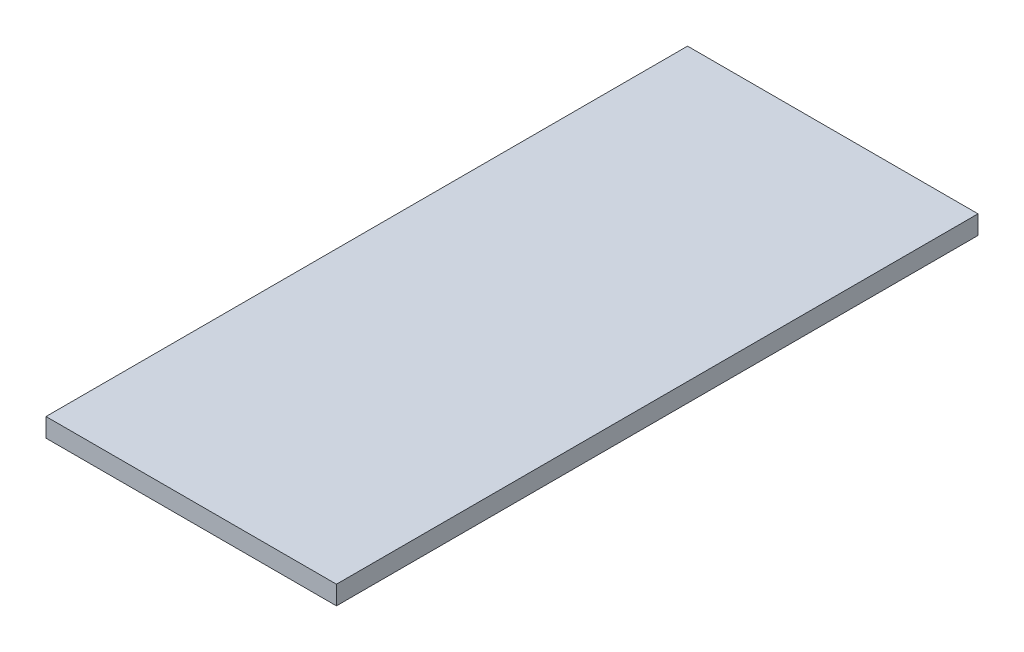
ISO-10303-21;
HEADER;
FILE_DESCRIPTION(('STEP AP214'),'2;1');
FILE_NAME('part.step','',(''),(''),'','','');
FILE_SCHEMA(('AUTOMOTIVE_DESIGN { 1 0 10303 214 1 1 1 1 }'));
ENDSEC;
DATA;
#1=APPLICATION_CONTEXT('core data for automotive mechanical design processes');
#2=APPLICATION_PROTOCOL_DEFINITION('international standard','automotive_design',2000,#1);
#3=PRODUCT_CONTEXT('',#1,'mechanical');
#4=PRODUCT('Part','Part','',(#3));
#5=PRODUCT_RELATED_PRODUCT_CATEGORY('part','',(#4));
#6=PRODUCT_DEFINITION_FORMATION('','',#4);
#7=PRODUCT_DEFINITION_CONTEXT('part definition',#1,'design');
#8=PRODUCT_DEFINITION('design','',#6,#7);
#9=PRODUCT_DEFINITION_SHAPE('','',#8);
#10=(LENGTH_UNIT() NAMED_UNIT(*) SI_UNIT(.MILLI.,.METRE.));
#11=(NAMED_UNIT(*) PLANE_ANGLE_UNIT() SI_UNIT($,.RADIAN.));
#12=(NAMED_UNIT(*) SI_UNIT($,.STERADIAN.) SOLID_ANGLE_UNIT());
#13=UNCERTAINTY_MEASURE_WITH_UNIT(LENGTH_MEASURE(1.E-05),#10,'distance_accuracy_value','');
#14=(GEOMETRIC_REPRESENTATION_CONTEXT(3) GLOBAL_UNCERTAINTY_ASSIGNED_CONTEXT((#13)) GLOBAL_UNIT_ASSIGNED_CONTEXT((#10,
#11,#12)) REPRESENTATION_CONTEXT('',''));
#15=CARTESIAN_POINT('',(0.,0.,0.));
#16=DIRECTION('',(0.,0.,1.));
#17=DIRECTION('',(1.,0.,0.));
#18=AXIS2_PLACEMENT_3D('',#15,#16,#17);
#19=CARTESIAN_POINT('',(484.407028553005,35.,-1190.08106279291));
#20=DIRECTION('',(0.,0.,1.));
#21=DIRECTION('',(1.,0.,0.));
#22=AXIS2_PLACEMENT_3D('',#19,#20,#21);
#23=PLANE('',#22);
#24=DIRECTION('',(-1.,0.,0.));
#25=VECTOR('',#24,1.);
#26=CARTESIAN_POINT('',(484.407028553005,0.,-1190.08106279291));
#27=LINE('',#26,#25);
#28=CARTESIAN_POINT('',(484.407028553005,0.,-1190.08106279291));
#29=VERTEX_POINT('',#28);
#30=CARTESIAN_POINT('',(-56.5929714469953,0.,-1190.08106279291));
#31=VERTEX_POINT('',#30);
#32=EDGE_CURVE('E102',#29,#31,#27,.T.);
#33=ORIENTED_EDGE('',*,*,#32,.T.);
#34=DIRECTION('',(0.,-1.,0.));
#35=VECTOR('',#34,1.);
#36=CARTESIAN_POINT('',(-56.5929714469953,35.,-1190.08106279291));
#37=LINE('',#36,#35);
#38=CARTESIAN_POINT('',(-56.5929714469953,35.,-1190.08106279291));
#39=VERTEX_POINT('',#38);
#40=EDGE_CURVE('E11',#39,#31,#37,.T.);
#41=ORIENTED_EDGE('',*,*,#40,.F.);
#42=DIRECTION('',(-1.,0.,0.));
#43=VECTOR('',#42,1.);
#44=CARTESIAN_POINT('',(484.407028553005,35.,-1190.08106279291));
#45=LINE('',#44,#43);
#46=CARTESIAN_POINT('',(484.407028553005,35.,-1190.08106279291));
#47=VERTEX_POINT('',#46);
#48=EDGE_CURVE('E90',#47,#39,#45,.T.);
#49=ORIENTED_EDGE('',*,*,#48,.F.);
#50=DIRECTION('',(0.,-1.,0.));
#51=VECTOR('',#50,1.);
#52=CARTESIAN_POINT('',(484.407028553005,35.,-1190.08106279291));
#53=LINE('',#52,#51);
#54=EDGE_CURVE('E98',#47,#29,#53,.T.);
#55=ORIENTED_EDGE('',*,*,#54,.T.);
#56=EDGE_LOOP('',(#33,#41,#49,#55));
#57=FACE_BOUND('',#56,.T.);
#58=ADVANCED_FACE('F39',(#57),#23,.F.);
#59=CARTESIAN_POINT('',(-56.5929714469953,35.,-1190.08106279291));
#60=DIRECTION('',(1.,0.,0.));
#61=DIRECTION('',(0.,0.,-1.));
#62=AXIS2_PLACEMENT_3D('',#59,#60,#61);
#63=PLANE('',#62);
#64=DIRECTION('',(0.,0.,1.));
#65=VECTOR('',#64,1.);
#66=CARTESIAN_POINT('',(-56.5929714469953,0.,-1190.08106279291));
#67=LINE('',#66,#65);
#68=CARTESIAN_POINT('',(-56.5929714469952,0.,4.91893720708857));
#69=VERTEX_POINT('',#68);
#70=EDGE_CURVE('E94',#31,#69,#67,.T.);
#71=ORIENTED_EDGE('',*,*,#70,.T.);
#72=DIRECTION('',(0.,-1.,0.));
#73=VECTOR('',#72,1.);
#74=CARTESIAN_POINT('',(-56.5929714469952,35.,4.91893720708857));
#75=LINE('',#74,#73);
#76=CARTESIAN_POINT('',(-56.5929714469952,35.,4.91893720708857));
#77=VERTEX_POINT('',#76);
#78=EDGE_CURVE('E47',#77,#69,#75,.T.);
#79=ORIENTED_EDGE('',*,*,#78,.F.);
#80=DIRECTION('',(0.,0.,1.));
#81=VECTOR('',#80,1.);
#82=CARTESIAN_POINT('',(-56.5929714469953,35.,-1190.08106279291));
#83=LINE('',#82,#81);
#84=EDGE_CURVE('E85',#39,#77,#83,.T.);
#85=ORIENTED_EDGE('',*,*,#84,.F.);
#86=ORIENTED_EDGE('',*,*,#40,.T.);
#87=EDGE_LOOP('',(#71,#79,#85,#86));
#88=FACE_BOUND('',#87,.T.);
#89=ADVANCED_FACE('F93',(#88),#63,.F.);
#90=CARTESIAN_POINT('',(-56.5929714469952,35.,4.91893720708857));
#91=DIRECTION('',(0.,0.,-1.));
#92=DIRECTION('',(-1.,0.,0.));
#93=AXIS2_PLACEMENT_3D('',#90,#91,#92);
#94=PLANE('',#93);
#95=DIRECTION('',(1.,0.,0.));
#96=VECTOR('',#95,1.);
#97=CARTESIAN_POINT('',(-56.5929714469952,0.,4.91893720708857));
#98=LINE('',#97,#96);
#99=CARTESIAN_POINT('',(484.407028553005,0.,4.91893720708857));
#100=VERTEX_POINT('',#99);
#101=EDGE_CURVE('E72',#69,#100,#98,.T.);
#102=ORIENTED_EDGE('',*,*,#101,.T.);
#103=DIRECTION('',(0.,-1.,0.));
#104=VECTOR('',#103,1.);
#105=CARTESIAN_POINT('',(484.407028553005,35.,4.91893720708857));
#106=LINE('',#105,#104);
#107=CARTESIAN_POINT('',(484.407028553005,35.,4.91893720708857));
#108=VERTEX_POINT('',#107);
#109=EDGE_CURVE('E95',#108,#100,#106,.T.);
#110=ORIENTED_EDGE('',*,*,#109,.F.);
#111=DIRECTION('',(1.,0.,0.));
#112=VECTOR('',#111,1.);
#113=CARTESIAN_POINT('',(-56.5929714469952,35.,4.91893720708857));
#114=LINE('',#113,#112);
#115=EDGE_CURVE('E88',#77,#108,#114,.T.);
#116=ORIENTED_EDGE('',*,*,#115,.F.);
#117=ORIENTED_EDGE('',*,*,#78,.T.);
#118=EDGE_LOOP('',(#102,#110,#116,#117));
#119=FACE_BOUND('',#118,.T.);
#120=ADVANCED_FACE('F96',(#119),#94,.F.);
#121=CARTESIAN_POINT('',(484.407028553005,35.,4.91893720708857));
#122=DIRECTION('',(-1.,0.,0.));
#123=DIRECTION('',(0.,0.,1.));
#124=AXIS2_PLACEMENT_3D('',#121,#122,#123);
#125=PLANE('',#124);
#126=DIRECTION('',(0.,0.,-1.));
#127=VECTOR('',#126,1.);
#128=CARTESIAN_POINT('',(484.407028553005,0.,4.91893720708857));
#129=LINE('',#128,#127);
#130=EDGE_CURVE('E78',#100,#29,#129,.T.);
#131=ORIENTED_EDGE('',*,*,#130,.T.);
#132=ORIENTED_EDGE('',*,*,#54,.F.);
#133=DIRECTION('',(0.,0.,-1.));
#134=VECTOR('',#133,1.);
#135=CARTESIAN_POINT('',(484.407028553005,35.,4.91893720708857));
#136=LINE('',#135,#134);
#137=EDGE_CURVE('E55',#108,#47,#136,.T.);
#138=ORIENTED_EDGE('',*,*,#137,.F.);
#139=ORIENTED_EDGE('',*,*,#109,.T.);
#140=EDGE_LOOP('',(#131,#132,#138,#139));
#141=FACE_BOUND('',#140,.T.);
#142=ADVANCED_FACE('F109',(#141),#125,.F.);
#143=CARTESIAN_POINT('',(0.,35.,0.));
#144=DIRECTION('',(0.,1.,0.));
#145=DIRECTION('',(0.,0.,1.));
#146=AXIS2_PLACEMENT_3D('',#143,#144,#145);
#147=PLANE('',#146);
#148=ORIENTED_EDGE('',*,*,#48,.T.);
#149=ORIENTED_EDGE('',*,*,#84,.T.);
#150=ORIENTED_EDGE('',*,*,#115,.T.);
#151=ORIENTED_EDGE('',*,*,#137,.T.);
#152=EDGE_LOOP('',(#148,#149,#150,#151));
#153=FACE_BOUND('',#152,.T.);
#154=ADVANCED_FACE('F86',(#153),#147,.T.);
#155=CARTESIAN_POINT('',(0.,0.,0.));
#156=DIRECTION('',(0.,1.,0.));
#157=DIRECTION('',(0.,0.,1.));
#158=AXIS2_PLACEMENT_3D('',#155,#156,#157);
#159=PLANE('',#158);
#160=ORIENTED_EDGE('',*,*,#32,.F.);
#161=ORIENTED_EDGE('',*,*,#130,.F.);
#162=ORIENTED_EDGE('',*,*,#101,.F.);
#163=ORIENTED_EDGE('',*,*,#70,.F.);
#164=EDGE_LOOP('',(#160,#161,#162,#163));
#165=FACE_BOUND('',#164,.T.);
#166=ADVANCED_FACE('F112',(#165),#159,.F.);
#167=CLOSED_SHELL('',(#58,#89,#120,#142,#154,#166));
#168=MANIFOLD_SOLID_BREP('B2',#167);
#169=ADVANCED_BREP_SHAPE_REPRESENTATION('',(#18,#168),#14);
#170=SHAPE_DEFINITION_REPRESENTATION(#9,#169);
ENDSEC;
END-ISO-10303-21;
